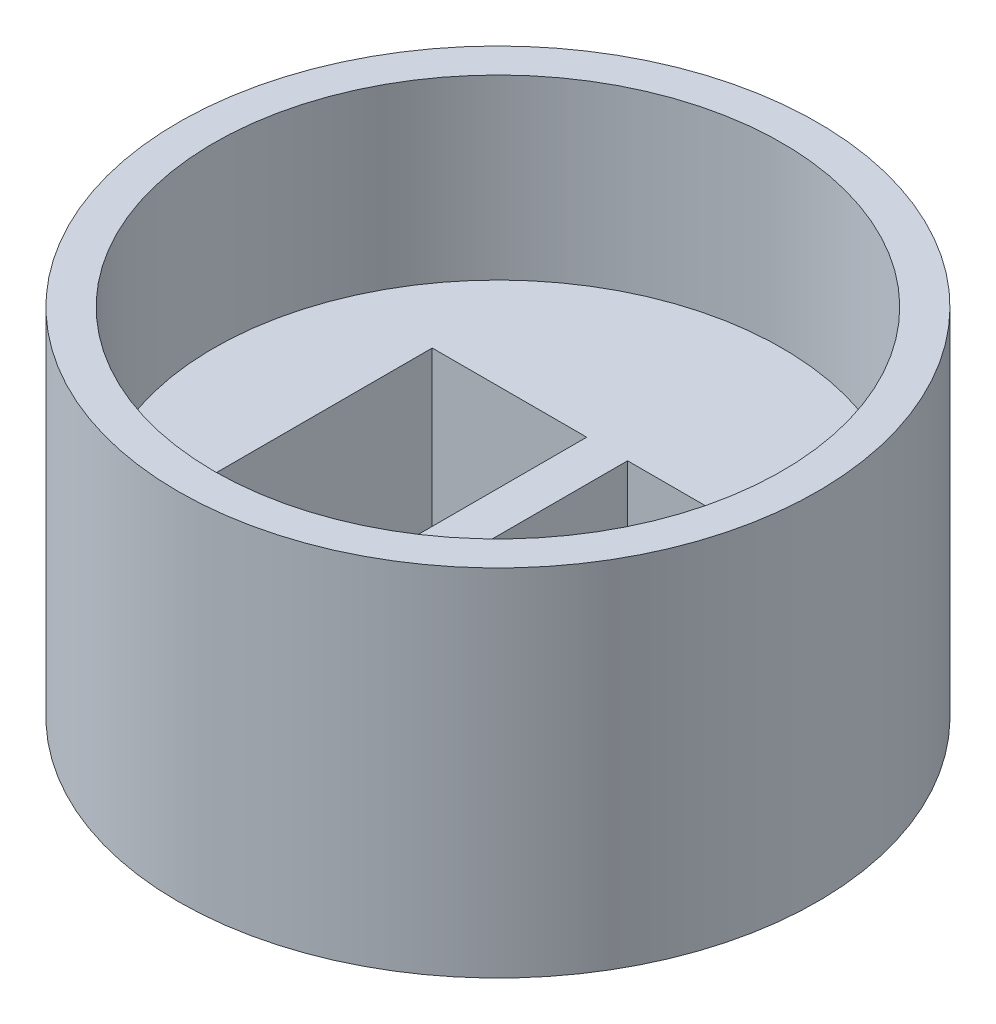
ISO-10303-21;
HEADER;
FILE_DESCRIPTION(('STEP AP214'),'2;1');
FILE_NAME('part.step','',(''),(''),'','','');
FILE_SCHEMA(('AUTOMOTIVE_DESIGN { 1 0 10303 214 1 1 1 1 }'));
ENDSEC;
DATA;
#1=APPLICATION_CONTEXT('core data for automotive mechanical design processes');
#2=APPLICATION_PROTOCOL_DEFINITION('international standard','automotive_design',2000,#1);
#3=PRODUCT_CONTEXT('',#1,'mechanical');
#4=PRODUCT('Part','Part','',(#3));
#5=PRODUCT_RELATED_PRODUCT_CATEGORY('part','',(#4));
#6=PRODUCT_DEFINITION_FORMATION('','',#4);
#7=PRODUCT_DEFINITION_CONTEXT('part definition',#1,'design');
#8=PRODUCT_DEFINITION('design','',#6,#7);
#9=PRODUCT_DEFINITION_SHAPE('','',#8);
#10=(LENGTH_UNIT() NAMED_UNIT(*) SI_UNIT(.MILLI.,.METRE.));
#11=(NAMED_UNIT(*) PLANE_ANGLE_UNIT() SI_UNIT($,.RADIAN.));
#12=(NAMED_UNIT(*) SI_UNIT($,.STERADIAN.) SOLID_ANGLE_UNIT());
#13=UNCERTAINTY_MEASURE_WITH_UNIT(LENGTH_MEASURE(1.E-05),#10,'distance_accuracy_value','');
#14=(GEOMETRIC_REPRESENTATION_CONTEXT(3) GLOBAL_UNCERTAINTY_ASSIGNED_CONTEXT((#13)) GLOBAL_UNIT_ASSIGNED_CONTEXT((#10,
#11,#12)) REPRESENTATION_CONTEXT('',''));
#15=CARTESIAN_POINT('',(0.,0.,0.));
#16=DIRECTION('',(0.,0.,1.));
#17=DIRECTION('',(1.,0.,0.));
#18=AXIS2_PLACEMENT_3D('',#15,#16,#17);
#19=CARTESIAN_POINT('',(0.,10.,0.));
#20=DIRECTION('',(0.,-1.,0.));
#21=DIRECTION('',(0.,0.,-1.));
#22=AXIS2_PLACEMENT_3D('',#19,#20,#21);
#23=CYLINDRICAL_SURFACE('',#22,9.);
#24=CARTESIAN_POINT('',(0.,10.,0.));
#25=DIRECTION('',(0.,1.,0.));
#26=DIRECTION('',(0.,0.,1.));
#27=AXIS2_PLACEMENT_3D('',#24,#25,#26);
#28=CIRCLE('',#27,9.);
#29=CARTESIAN_POINT('',(0.,10.,9.));
#30=VERTEX_POINT('',#29);
#31=EDGE_CURVE('E11',#30,#30,#28,.T.);
#32=ORIENTED_EDGE('',*,*,#31,.F.);
#33=EDGE_LOOP('',(#32));
#34=FACE_BOUND('',#33,.T.);
#35=CARTESIAN_POINT('',(0.,0.,0.));
#36=DIRECTION('',(0.,1.,0.));
#37=DIRECTION('',(0.,0.,1.));
#38=AXIS2_PLACEMENT_3D('',#35,#36,#37);
#39=CIRCLE('',#38,9.);
#40=CARTESIAN_POINT('',(0.,0.,9.));
#41=VERTEX_POINT('',#40);
#42=EDGE_CURVE('E38',#41,#41,#39,.T.);
#43=ORIENTED_EDGE('',*,*,#42,.T.);
#44=EDGE_LOOP('',(#43));
#45=FACE_BOUND('',#44,.T.);
#46=ADVANCED_FACE('F35',(#34,#45),#23,.T.);
#47=CARTESIAN_POINT('',(0.,10.,0.));
#48=DIRECTION('',(0.,1.,0.));
#49=DIRECTION('',(0.,0.,1.));
#50=AXIS2_PLACEMENT_3D('',#47,#48,#49);
#51=PLANE('',#50);
#52=CARTESIAN_POINT('',(0.,10.,0.));
#53=DIRECTION('',(0.,1.,0.));
#54=DIRECTION('',(0.,0.,1.));
#55=AXIS2_PLACEMENT_3D('',#52,#53,#54);
#56=CIRCLE('',#55,8.);
#57=CARTESIAN_POINT('',(0.,10.,8.));
#58=VERTEX_POINT('',#57);
#59=EDGE_CURVE('E161',#58,#58,#56,.T.);
#60=ORIENTED_EDGE('',*,*,#59,.F.);
#61=EDGE_LOOP('',(#60));
#62=FACE_BOUND('',#61,.T.);
#63=ORIENTED_EDGE('',*,*,#31,.T.);
#64=EDGE_LOOP('',(#63));
#65=FACE_BOUND('',#64,.T.);
#66=ADVANCED_FACE('F176',(#62,#65),#51,.T.);
#67=CARTESIAN_POINT('',(0.,0.,0.));
#68=DIRECTION('',(0.,1.,0.));
#69=DIRECTION('',(0.,0.,1.));
#70=AXIS2_PLACEMENT_3D('',#67,#68,#69);
#71=PLANE('',#70);
#72=DIRECTION('',(1.,0.,0.));
#73=VECTOR('',#72,1.);
#74=CARTESIAN_POINT('',(-4.925,0.,3.075));
#75=LINE('',#74,#73);
#76=CARTESIAN_POINT('',(-4.925,0.,3.075));
#77=VERTEX_POINT('',#76);
#78=CARTESIAN_POINT('',(-0.575,0.,3.075));
#79=VERTEX_POINT('',#78);
#80=EDGE_CURVE('E107',#77,#79,#75,.T.);
#81=ORIENTED_EDGE('',*,*,#80,.T.);
#82=DIRECTION('',(0.,0.,-1.));
#83=VECTOR('',#82,1.);
#84=CARTESIAN_POINT('',(-0.575000000000001,0.,-3.075));
#85=LINE('',#84,#83);
#86=CARTESIAN_POINT('',(-0.575000000000001,0.,-3.075));
#87=VERTEX_POINT('',#86);
#88=EDGE_CURVE('E101',#79,#87,#85,.T.);
#89=ORIENTED_EDGE('',*,*,#88,.T.);
#90=DIRECTION('',(-1.,0.,0.));
#91=VECTOR('',#90,1.);
#92=CARTESIAN_POINT('',(-4.925,0.,-3.075));
#93=LINE('',#92,#91);
#94=CARTESIAN_POINT('',(-4.925,0.,-3.075));
#95=VERTEX_POINT('',#94);
#96=EDGE_CURVE('E110',#87,#95,#93,.T.);
#97=ORIENTED_EDGE('',*,*,#96,.T.);
#98=DIRECTION('',(0.,0.,1.));
#99=VECTOR('',#98,1.);
#100=CARTESIAN_POINT('',(-4.925,0.,-3.075));
#101=LINE('',#100,#99);
#102=EDGE_CURVE('E49',#95,#77,#101,.T.);
#103=ORIENTED_EDGE('',*,*,#102,.T.);
#104=EDGE_LOOP('',(#81,#89,#97,#103));
#105=FACE_BOUND('',#104,.T.);
#106=DIRECTION('',(-1.,0.,0.));
#107=VECTOR('',#106,1.);
#108=CARTESIAN_POINT('',(4.925,0.,-3.075));
#109=LINE('',#108,#107);
#110=CARTESIAN_POINT('',(4.925,0.,-3.075));
#111=VERTEX_POINT('',#110);
#112=CARTESIAN_POINT('',(0.575,0.,-3.075));
#113=VERTEX_POINT('',#112);
#114=EDGE_CURVE('E146',#111,#113,#109,.T.);
#115=ORIENTED_EDGE('',*,*,#114,.T.);
#116=DIRECTION('',(0.,0.,1.));
#117=VECTOR('',#116,1.);
#118=CARTESIAN_POINT('',(0.575,0.,3.075));
#119=LINE('',#118,#117);
#120=CARTESIAN_POINT('',(0.575,0.,3.075));
#121=VERTEX_POINT('',#120);
#122=EDGE_CURVE('E136',#113,#121,#119,.T.);
#123=ORIENTED_EDGE('',*,*,#122,.T.);
#124=DIRECTION('',(1.,0.,0.));
#125=VECTOR('',#124,1.);
#126=CARTESIAN_POINT('',(4.925,0.,3.075));
#127=LINE('',#126,#125);
#128=CARTESIAN_POINT('',(4.925,0.,3.075));
#129=VERTEX_POINT('',#128);
#130=EDGE_CURVE('E139',#121,#129,#127,.T.);
#131=ORIENTED_EDGE('',*,*,#130,.T.);
#132=DIRECTION('',(0.,0.,-1.));
#133=VECTOR('',#132,1.);
#134=CARTESIAN_POINT('',(4.925,0.,3.075));
#135=LINE('',#134,#133);
#136=EDGE_CURVE('E143',#129,#111,#135,.T.);
#137=ORIENTED_EDGE('',*,*,#136,.T.);
#138=EDGE_LOOP('',(#115,#123,#131,#137));
#139=FACE_BOUND('',#138,.T.);
#140=ORIENTED_EDGE('',*,*,#42,.F.);
#141=EDGE_LOOP('',(#140));
#142=FACE_BOUND('',#141,.T.);
#143=ADVANCED_FACE('F114',(#105,#139,#142),#71,.F.);
#144=CARTESIAN_POINT('',(0.,5.,0.));
#145=DIRECTION('',(0.,1.,0.));
#146=DIRECTION('',(0.,0.,1.));
#147=AXIS2_PLACEMENT_3D('',#144,#145,#146);
#148=CYLINDRICAL_SURFACE('',#147,8.);
#149=CARTESIAN_POINT('',(0.,5.,0.));
#150=DIRECTION('',(0.,1.,0.));
#151=DIRECTION('',(0.,0.,1.));
#152=AXIS2_PLACEMENT_3D('',#149,#150,#151);
#153=CIRCLE('',#152,8.);
#154=CARTESIAN_POINT('',(0.,5.,8.));
#155=VERTEX_POINT('',#154);
#156=EDGE_CURVE('E168',#155,#155,#153,.T.);
#157=ORIENTED_EDGE('',*,*,#156,.F.);
#158=EDGE_LOOP('',(#157));
#159=FACE_BOUND('',#158,.T.);
#160=ORIENTED_EDGE('',*,*,#59,.T.);
#161=EDGE_LOOP('',(#160));
#162=FACE_BOUND('',#161,.T.);
#163=ADVANCED_FACE('F174',(#159,#162),#148,.F.);
#164=CARTESIAN_POINT('',(0.,5.,0.));
#165=DIRECTION('',(0.,1.,0.));
#166=DIRECTION('',(0.,0.,1.));
#167=AXIS2_PLACEMENT_3D('',#164,#165,#166);
#168=PLANE('',#167);
#169=DIRECTION('',(0.,0.,-1.));
#170=VECTOR('',#169,1.);
#171=CARTESIAN_POINT('',(-0.575000000000001,5.,-3.075));
#172=LINE('',#171,#170);
#173=CARTESIAN_POINT('',(-0.575,5.,3.075));
#174=VERTEX_POINT('',#173);
#175=CARTESIAN_POINT('',(-0.575000000000001,5.,-3.075));
#176=VERTEX_POINT('',#175);
#177=EDGE_CURVE('E57',#174,#176,#172,.T.);
#178=ORIENTED_EDGE('',*,*,#177,.F.);
#179=DIRECTION('',(1.,0.,0.));
#180=VECTOR('',#179,1.);
#181=CARTESIAN_POINT('',(-4.925,5.,3.075));
#182=LINE('',#181,#180);
#183=CARTESIAN_POINT('',(-4.925,5.,3.075));
#184=VERTEX_POINT('',#183);
#185=EDGE_CURVE('E117',#184,#174,#182,.T.);
#186=ORIENTED_EDGE('',*,*,#185,.F.);
#187=DIRECTION('',(0.,0.,1.));
#188=VECTOR('',#187,1.);
#189=CARTESIAN_POINT('',(-4.925,5.,-3.075));
#190=LINE('',#189,#188);
#191=CARTESIAN_POINT('',(-4.925,5.,-3.075));
#192=VERTEX_POINT('',#191);
#193=EDGE_CURVE('E120',#192,#184,#190,.T.);
#194=ORIENTED_EDGE('',*,*,#193,.F.);
#195=DIRECTION('',(-1.,0.,0.));
#196=VECTOR('',#195,1.);
#197=CARTESIAN_POINT('',(-4.925,5.,-3.075));
#198=LINE('',#197,#196);
#199=EDGE_CURVE('E126',#176,#192,#198,.T.);
#200=ORIENTED_EDGE('',*,*,#199,.F.);
#201=EDGE_LOOP('',(#178,#186,#194,#200));
#202=FACE_BOUND('',#201,.T.);
#203=DIRECTION('',(0.,0.,1.));
#204=VECTOR('',#203,1.);
#205=CARTESIAN_POINT('',(0.575,5.,3.075));
#206=LINE('',#205,#204);
#207=CARTESIAN_POINT('',(0.575,5.,-3.075));
#208=VERTEX_POINT('',#207);
#209=CARTESIAN_POINT('',(0.575,5.,3.075));
#210=VERTEX_POINT('',#209);
#211=EDGE_CURVE('E132',#208,#210,#206,.T.);
#212=ORIENTED_EDGE('',*,*,#211,.F.);
#213=DIRECTION('',(-1.,0.,0.));
#214=VECTOR('',#213,1.);
#215=CARTESIAN_POINT('',(4.925,5.,-3.075));
#216=LINE('',#215,#214);
#217=CARTESIAN_POINT('',(4.925,5.,-3.075));
#218=VERTEX_POINT('',#217);
#219=EDGE_CURVE('E140',#218,#208,#216,.T.);
#220=ORIENTED_EDGE('',*,*,#219,.F.);
#221=DIRECTION('',(0.,0.,-1.));
#222=VECTOR('',#221,1.);
#223=CARTESIAN_POINT('',(4.925,5.,3.075));
#224=LINE('',#223,#222);
#225=CARTESIAN_POINT('',(4.925,5.,3.075));
#226=VERTEX_POINT('',#225);
#227=EDGE_CURVE('E154',#226,#218,#224,.T.);
#228=ORIENTED_EDGE('',*,*,#227,.F.);
#229=DIRECTION('',(1.,0.,0.));
#230=VECTOR('',#229,1.);
#231=CARTESIAN_POINT('',(4.925,5.,3.075));
#232=LINE('',#231,#230);
#233=EDGE_CURVE('E151',#210,#226,#232,.T.);
#234=ORIENTED_EDGE('',*,*,#233,.F.);
#235=EDGE_LOOP('',(#212,#220,#228,#234));
#236=FACE_BOUND('',#235,.T.);
#237=ORIENTED_EDGE('',*,*,#156,.T.);
#238=EDGE_LOOP('',(#237));
#239=FACE_BOUND('',#238,.T.);
#240=ADVANCED_FACE('F191',(#202,#236,#239),#168,.T.);
#241=CARTESIAN_POINT('',(0.575,0.,3.075));
#242=DIRECTION('',(-1.,0.,0.));
#243=DIRECTION('',(0.,0.,1.));
#244=AXIS2_PLACEMENT_3D('',#241,#242,#243);
#245=PLANE('',#244);
#246=ORIENTED_EDGE('',*,*,#211,.T.);
#247=DIRECTION('',(0.,1.,0.));
#248=VECTOR('',#247,1.);
#249=CARTESIAN_POINT('',(0.575,0.,3.075));
#250=LINE('',#249,#248);
#251=EDGE_CURVE('E149',#121,#210,#250,.T.);
#252=ORIENTED_EDGE('',*,*,#251,.F.);
#253=ORIENTED_EDGE('',*,*,#122,.F.);
#254=DIRECTION('',(0.,1.,0.));
#255=VECTOR('',#254,1.);
#256=CARTESIAN_POINT('',(0.575,0.,-3.075));
#257=LINE('',#256,#255);
#258=EDGE_CURVE('E159',#113,#208,#257,.T.);
#259=ORIENTED_EDGE('',*,*,#258,.T.);
#260=EDGE_LOOP('',(#246,#252,#253,#259));
#261=FACE_BOUND('',#260,.T.);
#262=ADVANCED_FACE('F197',(#261),#245,.F.);
#263=CARTESIAN_POINT('',(4.925,0.,-3.075));
#264=DIRECTION('',(0.,0.,-1.));
#265=DIRECTION('',(-1.,0.,0.));
#266=AXIS2_PLACEMENT_3D('',#263,#264,#265);
#267=PLANE('',#266);
#268=ORIENTED_EDGE('',*,*,#219,.T.);
#269=ORIENTED_EDGE('',*,*,#258,.F.);
#270=ORIENTED_EDGE('',*,*,#114,.F.);
#271=DIRECTION('',(0.,1.,0.));
#272=VECTOR('',#271,1.);
#273=CARTESIAN_POINT('',(4.925,0.,-3.075));
#274=LINE('',#273,#272);
#275=EDGE_CURVE('E162',#111,#218,#274,.T.);
#276=ORIENTED_EDGE('',*,*,#275,.T.);
#277=EDGE_LOOP('',(#268,#269,#270,#276));
#278=FACE_BOUND('',#277,.T.);
#279=ADVANCED_FACE('F201',(#278),#267,.F.);
#280=CARTESIAN_POINT('',(4.925,0.,3.075));
#281=DIRECTION('',(1.,0.,0.));
#282=DIRECTION('',(0.,0.,-1.));
#283=AXIS2_PLACEMENT_3D('',#280,#281,#282);
#284=PLANE('',#283);
#285=ORIENTED_EDGE('',*,*,#227,.T.);
#286=ORIENTED_EDGE('',*,*,#275,.F.);
#287=ORIENTED_EDGE('',*,*,#136,.F.);
#288=DIRECTION('',(0.,1.,0.));
#289=VECTOR('',#288,1.);
#290=CARTESIAN_POINT('',(4.925,0.,3.075));
#291=LINE('',#290,#289);
#292=EDGE_CURVE('E164',#129,#226,#291,.T.);
#293=ORIENTED_EDGE('',*,*,#292,.T.);
#294=EDGE_LOOP('',(#285,#286,#287,#293));
#295=FACE_BOUND('',#294,.T.);
#296=ADVANCED_FACE('F206',(#295),#284,.F.);
#297=CARTESIAN_POINT('',(4.925,0.,3.075));
#298=DIRECTION('',(0.,0.,1.));
#299=DIRECTION('',(1.,0.,0.));
#300=AXIS2_PLACEMENT_3D('',#297,#298,#299);
#301=PLANE('',#300);
#302=ORIENTED_EDGE('',*,*,#233,.T.);
#303=ORIENTED_EDGE('',*,*,#292,.F.);
#304=ORIENTED_EDGE('',*,*,#130,.F.);
#305=ORIENTED_EDGE('',*,*,#251,.T.);
#306=EDGE_LOOP('',(#302,#303,#304,#305));
#307=FACE_BOUND('',#306,.T.);
#308=ADVANCED_FACE('F203',(#307),#301,.F.);
#309=CARTESIAN_POINT('',(-0.575000000000001,0.,-3.075));
#310=DIRECTION('',(1.,0.,0.));
#311=DIRECTION('',(0.,0.,-1.));
#312=AXIS2_PLACEMENT_3D('',#309,#310,#311);
#313=PLANE('',#312);
#314=ORIENTED_EDGE('',*,*,#177,.T.);
#315=DIRECTION('',(0.,1.,0.));
#316=VECTOR('',#315,1.);
#317=CARTESIAN_POINT('',(-0.575000000000001,0.,-3.075));
#318=LINE('',#317,#316);
#319=EDGE_CURVE('E97',#87,#176,#318,.T.);
#320=ORIENTED_EDGE('',*,*,#319,.F.);
#321=ORIENTED_EDGE('',*,*,#88,.F.);
#322=DIRECTION('',(0.,1.,0.));
#323=VECTOR('',#322,1.);
#324=CARTESIAN_POINT('',(-0.575,0.,3.075));
#325=LINE('',#324,#323);
#326=EDGE_CURVE('E130',#79,#174,#325,.T.);
#327=ORIENTED_EDGE('',*,*,#326,.T.);
#328=EDGE_LOOP('',(#314,#320,#321,#327));
#329=FACE_BOUND('',#328,.T.);
#330=ADVANCED_FACE('F99',(#329),#313,.F.);
#331=CARTESIAN_POINT('',(-4.925,0.,3.075));
#332=DIRECTION('',(0.,0.,1.));
#333=DIRECTION('',(1.,0.,0.));
#334=AXIS2_PLACEMENT_3D('',#331,#332,#333);
#335=PLANE('',#334);
#336=ORIENTED_EDGE('',*,*,#185,.T.);
#337=ORIENTED_EDGE('',*,*,#326,.F.);
#338=ORIENTED_EDGE('',*,*,#80,.F.);
#339=DIRECTION('',(0.,1.,0.));
#340=VECTOR('',#339,1.);
#341=CARTESIAN_POINT('',(-4.925,0.,3.075));
#342=LINE('',#341,#340);
#343=EDGE_CURVE('E133',#77,#184,#342,.T.);
#344=ORIENTED_EDGE('',*,*,#343,.T.);
#345=EDGE_LOOP('',(#336,#337,#338,#344));
#346=FACE_BOUND('',#345,.T.);
#347=ADVANCED_FACE('F216',(#346),#335,.F.);
#348=CARTESIAN_POINT('',(-4.925,0.,-3.075));
#349=DIRECTION('',(-1.,0.,0.));
#350=DIRECTION('',(0.,0.,1.));
#351=AXIS2_PLACEMENT_3D('',#348,#349,#350);
#352=PLANE('',#351);
#353=ORIENTED_EDGE('',*,*,#193,.T.);
#354=ORIENTED_EDGE('',*,*,#343,.F.);
#355=ORIENTED_EDGE('',*,*,#102,.F.);
#356=DIRECTION('',(0.,1.,0.));
#357=VECTOR('',#356,1.);
#358=CARTESIAN_POINT('',(-4.925,0.,-3.075));
#359=LINE('',#358,#357);
#360=EDGE_CURVE('E106',#95,#192,#359,.T.);
#361=ORIENTED_EDGE('',*,*,#360,.T.);
#362=EDGE_LOOP('',(#353,#354,#355,#361));
#363=FACE_BOUND('',#362,.T.);
#364=ADVANCED_FACE('F219',(#363),#352,.F.);
#365=CARTESIAN_POINT('',(-4.925,0.,-3.075));
#366=DIRECTION('',(0.,0.,-1.));
#367=DIRECTION('',(-1.,0.,0.));
#368=AXIS2_PLACEMENT_3D('',#365,#366,#367);
#369=PLANE('',#368);
#370=ORIENTED_EDGE('',*,*,#199,.T.);
#371=ORIENTED_EDGE('',*,*,#360,.F.);
#372=ORIENTED_EDGE('',*,*,#96,.F.);
#373=ORIENTED_EDGE('',*,*,#319,.T.);
#374=EDGE_LOOP('',(#370,#371,#372,#373));
#375=FACE_BOUND('',#374,.T.);
#376=ADVANCED_FACE('F111',(#375),#369,.F.);
#377=CLOSED_SHELL('',(#46,#66,#143,#163,#240,#262,#279,#296,#308,#330,#347,#364,#376));
#378=MANIFOLD_SOLID_BREP('B2',#377);
#379=ADVANCED_BREP_SHAPE_REPRESENTATION('',(#18,#378),#14);
#380=SHAPE_DEFINITION_REPRESENTATION(#9,#379);
ENDSEC;
END-ISO-10303-21;
